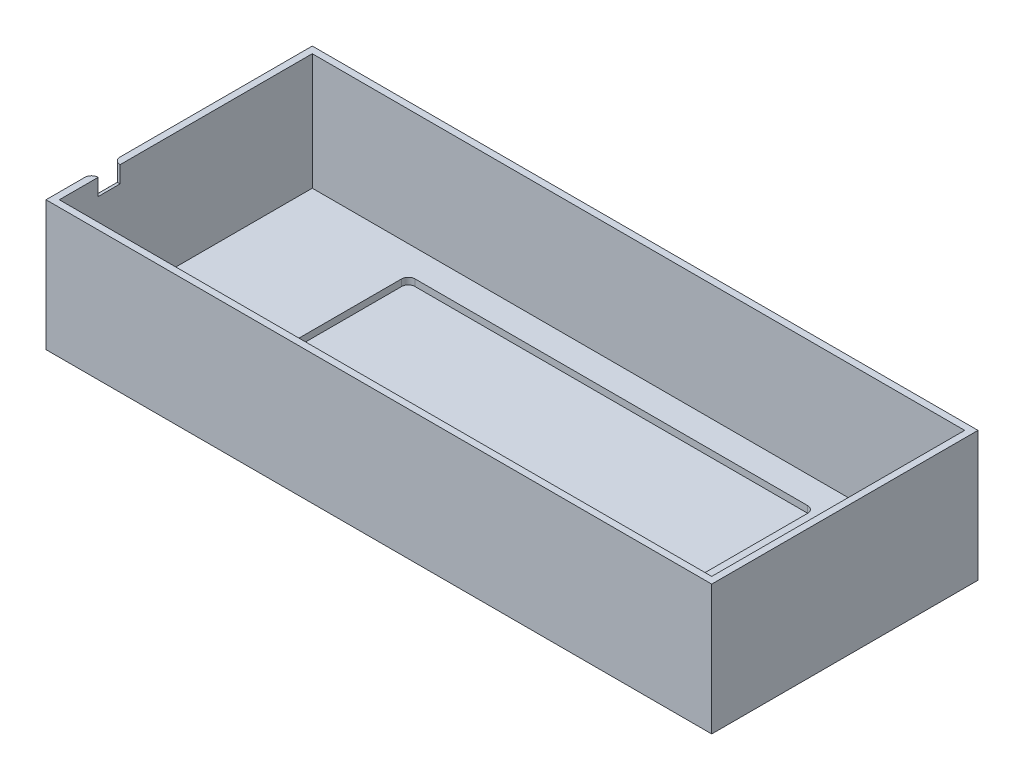
ISO-10303-21;
HEADER;
FILE_DESCRIPTION(('STEP AP214'),'2;1');
FILE_NAME('part.step','',(''),(''),'','','');
FILE_SCHEMA(('AUTOMOTIVE_DESIGN { 1 0 10303 214 1 1 1 1 }'));
ENDSEC;
DATA;
#1=APPLICATION_CONTEXT('core data for automotive mechanical design processes');
#2=APPLICATION_PROTOCOL_DEFINITION('international standard','automotive_design',2000,#1);
#3=PRODUCT_CONTEXT('',#1,'mechanical');
#4=PRODUCT('Part','Part','',(#3));
#5=PRODUCT_RELATED_PRODUCT_CATEGORY('part','',(#4));
#6=PRODUCT_DEFINITION_FORMATION('','',#4);
#7=PRODUCT_DEFINITION_CONTEXT('part definition',#1,'design');
#8=PRODUCT_DEFINITION('design','',#6,#7);
#9=PRODUCT_DEFINITION_SHAPE('','',#8);
#10=(LENGTH_UNIT() NAMED_UNIT(*) SI_UNIT(.MILLI.,.METRE.));
#11=(NAMED_UNIT(*) PLANE_ANGLE_UNIT() SI_UNIT($,.RADIAN.));
#12=(NAMED_UNIT(*) SI_UNIT($,.STERADIAN.) SOLID_ANGLE_UNIT());
#13=UNCERTAINTY_MEASURE_WITH_UNIT(LENGTH_MEASURE(1.E-05),#10,'distance_accuracy_value','');
#14=(GEOMETRIC_REPRESENTATION_CONTEXT(3) GLOBAL_UNCERTAINTY_ASSIGNED_CONTEXT((#13)) GLOBAL_UNIT_ASSIGNED_CONTEXT((#10,
#11,#12)) REPRESENTATION_CONTEXT('',''));
#15=CARTESIAN_POINT('',(0.,0.,0.));
#16=DIRECTION('',(0.,0.,1.));
#17=DIRECTION('',(1.,0.,0.));
#18=AXIS2_PLACEMENT_3D('',#15,#16,#17);
#19=CARTESIAN_POINT('',(0.,2.,0.));
#20=DIRECTION('',(0.,-1.,0.));
#21=DIRECTION('',(0.,0.,-1.));
#22=AXIS2_PLACEMENT_3D('',#19,#20,#21);
#23=PLANE('',#22);
#24=DIRECTION('',(0.,0.,1.));
#25=VECTOR('',#24,1.);
#26=CARTESIAN_POINT('',(-98.,2.,0.));
#27=LINE('',#26,#25);
#28=CARTESIAN_POINT('',(-98.,2.,-38.));
#29=VERTEX_POINT('',#28);
#30=CARTESIAN_POINT('',(-98.,2.,38.));
#31=VERTEX_POINT('',#30);
#32=EDGE_CURVE('E307',#29,#31,#27,.T.);
#33=ORIENTED_EDGE('',*,*,#32,.T.);
#34=DIRECTION('',(1.,0.,0.));
#35=VECTOR('',#34,1.);
#36=CARTESIAN_POINT('',(0.,2.,38.));
#37=LINE('',#36,#35);
#38=CARTESIAN_POINT('',(98.,2.,38.));
#39=VERTEX_POINT('',#38);
#40=EDGE_CURVE('E320',#31,#39,#37,.T.);
#41=ORIENTED_EDGE('',*,*,#40,.T.);
#42=DIRECTION('',(0.,0.,-1.));
#43=VECTOR('',#42,1.);
#44=CARTESIAN_POINT('',(98.,2.,0.));
#45=LINE('',#44,#43);
#46=CARTESIAN_POINT('',(98.,2.,-38.));
#47=VERTEX_POINT('',#46);
#48=EDGE_CURVE('E203',#39,#47,#45,.T.);
#49=ORIENTED_EDGE('',*,*,#48,.T.);
#50=DIRECTION('',(-1.,0.,0.));
#51=VECTOR('',#50,1.);
#52=CARTESIAN_POINT('',(0.,2.,-38.));
#53=LINE('',#52,#51);
#54=EDGE_CURVE('E200',#47,#29,#53,.T.);
#55=ORIENTED_EDGE('',*,*,#54,.T.);
#56=EDGE_LOOP('',(#33,#41,#49,#55));
#57=FACE_BOUND('',#56,.T.);
#58=DIRECTION('',(0.,0.,1.));
#59=VECTOR('',#58,1.);
#60=CARTESIAN_POINT('',(-61.,2.,-29.845));
#61=LINE('',#60,#59);
#62=CARTESIAN_POINT('',(-61.,2.,-27.845));
#63=VERTEX_POINT('',#62);
#64=CARTESIAN_POINT('',(-61.,2.,27.845));
#65=VERTEX_POINT('',#64);
#66=EDGE_CURVE('E293',#63,#65,#61,.T.);
#67=ORIENTED_EDGE('',*,*,#66,.F.);
#68=CARTESIAN_POINT('',(-59.,2.,-27.845));
#69=DIRECTION('',(0.,-1.,0.));
#70=DIRECTION('',(0.,0.,-1.));
#71=AXIS2_PLACEMENT_3D('',#68,#69,#70);
#72=CIRCLE('',#71,2.);
#73=CARTESIAN_POINT('',(-59.,2.,-29.845));
#74=VERTEX_POINT('',#73);
#75=EDGE_CURVE('E266',#63,#74,#72,.T.);
#76=ORIENTED_EDGE('',*,*,#75,.T.);
#77=DIRECTION('',(-1.,0.,0.));
#78=VECTOR('',#77,1.);
#79=CARTESIAN_POINT('',(61.,2.,-29.845));
#80=LINE('',#79,#78);
#81=CARTESIAN_POINT('',(59.,2.,-29.845));
#82=VERTEX_POINT('',#81);
#83=EDGE_CURVE('E298',#82,#74,#80,.T.);
#84=ORIENTED_EDGE('',*,*,#83,.F.);
#85=CARTESIAN_POINT('',(59.,2.,-27.845));
#86=DIRECTION('',(0.,-1.,0.));
#87=DIRECTION('',(0.,0.,-1.));
#88=AXIS2_PLACEMENT_3D('',#85,#86,#87);
#89=CIRCLE('',#88,2.);
#90=CARTESIAN_POINT('',(61.,2.,-27.845));
#91=VERTEX_POINT('',#90);
#92=EDGE_CURVE('E262',#82,#91,#89,.T.);
#93=ORIENTED_EDGE('',*,*,#92,.T.);
#94=DIRECTION('',(0.,0.,-1.));
#95=VECTOR('',#94,1.);
#96=CARTESIAN_POINT('',(61.,2.,-29.845));
#97=LINE('',#96,#95);
#98=CARTESIAN_POINT('',(61.,2.,27.845));
#99=VERTEX_POINT('',#98);
#100=EDGE_CURVE('E313',#99,#91,#97,.T.);
#101=ORIENTED_EDGE('',*,*,#100,.F.);
#102=CARTESIAN_POINT('',(59.,2.,27.845));
#103=DIRECTION('',(0.,-1.,0.));
#104=DIRECTION('',(0.,0.,-1.));
#105=AXIS2_PLACEMENT_3D('',#102,#103,#104);
#106=CIRCLE('',#105,2.);
#107=CARTESIAN_POINT('',(59.,2.,29.845));
#108=VERTEX_POINT('',#107);
#109=EDGE_CURVE('E260',#99,#108,#106,.T.);
#110=ORIENTED_EDGE('',*,*,#109,.T.);
#111=DIRECTION('',(1.,0.,0.));
#112=VECTOR('',#111,1.);
#113=CARTESIAN_POINT('',(61.,2.,29.845));
#114=LINE('',#113,#112);
#115=CARTESIAN_POINT('',(-59.,2.,29.845));
#116=VERTEX_POINT('',#115);
#117=EDGE_CURVE('E310',#116,#108,#114,.T.);
#118=ORIENTED_EDGE('',*,*,#117,.F.);
#119=CARTESIAN_POINT('',(-59.,2.,27.845));
#120=DIRECTION('',(0.,-1.,0.));
#121=DIRECTION('',(0.,0.,-1.));
#122=AXIS2_PLACEMENT_3D('',#119,#120,#121);
#123=CIRCLE('',#122,2.);
#124=EDGE_CURVE('E264',#116,#65,#123,.T.);
#125=ORIENTED_EDGE('',*,*,#124,.T.);
#126=EDGE_LOOP('',(#67,#76,#84,#93,#101,#110,#118,#125));
#127=FACE_BOUND('',#126,.T.);
#128=ADVANCED_FACE('F42',(#57,#127),#23,.F.);
#129=CARTESIAN_POINT('',(0.,37.,0.));
#130=DIRECTION('',(0.,-1.,0.));
#131=DIRECTION('',(0.,0.,-1.));
#132=AXIS2_PLACEMENT_3D('',#129,#130,#131);
#133=PLANE('',#132);
#134=DIRECTION('',(0.,0.,1.));
#135=VECTOR('',#134,1.);
#136=CARTESIAN_POINT('',(-98.,37.,0.));
#137=LINE('',#136,#135);
#138=CARTESIAN_POINT('',(-98.,37.,26.33));
#139=VERTEX_POINT('',#138);
#140=CARTESIAN_POINT('',(-98.,37.,38.));
#141=VERTEX_POINT('',#140);
#142=EDGE_CURVE('E189',#139,#141,#137,.T.);
#143=ORIENTED_EDGE('',*,*,#142,.F.);
#144=CARTESIAN_POINT('',(-98.,37.,28.33));
#145=DIRECTION('',(0.,-1.,0.));
#146=DIRECTION('',(0.,0.,-1.));
#147=AXIS2_PLACEMENT_3D('',#144,#145,#146);
#148=CIRCLE('',#147,2.);
#149=CARTESIAN_POINT('',(-100.,37.,28.33));
#150=VERTEX_POINT('',#149);
#151=EDGE_CURVE('E177',#139,#150,#148,.F.);
#152=ORIENTED_EDGE('',*,*,#151,.T.);
#153=DIRECTION('',(0.,0.,1.));
#154=VECTOR('',#153,1.);
#155=CARTESIAN_POINT('',(-100.,37.,-40.));
#156=LINE('',#155,#154);
#157=CARTESIAN_POINT('',(-100.,37.,40.));
#158=VERTEX_POINT('',#157);
#159=EDGE_CURVE('E218',#150,#158,#156,.T.);
#160=ORIENTED_EDGE('',*,*,#159,.T.);
#161=DIRECTION('',(1.,0.,0.));
#162=VECTOR('',#161,1.);
#163=CARTESIAN_POINT('',(100.,37.,40.));
#164=LINE('',#163,#162);
#165=CARTESIAN_POINT('',(100.,37.,40.));
#166=VERTEX_POINT('',#165);
#167=EDGE_CURVE('E217',#158,#166,#164,.T.);
#168=ORIENTED_EDGE('',*,*,#167,.T.);
#169=DIRECTION('',(0.,0.,-1.));
#170=VECTOR('',#169,1.);
#171=CARTESIAN_POINT('',(100.,37.,-40.));
#172=LINE('',#171,#170);
#173=CARTESIAN_POINT('',(100.,37.,-40.));
#174=VERTEX_POINT('',#173);
#175=EDGE_CURVE('E220',#166,#174,#172,.T.);
#176=ORIENTED_EDGE('',*,*,#175,.T.);
#177=DIRECTION('',(-1.,0.,0.));
#178=VECTOR('',#177,1.);
#179=CARTESIAN_POINT('',(100.,37.,-40.));
#180=LINE('',#179,#178);
#181=CARTESIAN_POINT('',(-100.,37.,-40.));
#182=VERTEX_POINT('',#181);
#183=EDGE_CURVE('E222',#174,#182,#180,.T.);
#184=ORIENTED_EDGE('',*,*,#183,.T.);
#185=CARTESIAN_POINT('',(-100.,37.,17.7544689442229));
#186=VERTEX_POINT('',#185);
#187=EDGE_CURVE('E214',#182,#186,#156,.T.);
#188=ORIENTED_EDGE('',*,*,#187,.T.);
#189=CARTESIAN_POINT('',(-98.,37.,17.7544689442229));
#190=DIRECTION('',(0.,-1.,0.));
#191=DIRECTION('',(0.,0.,-1.));
#192=AXIS2_PLACEMENT_3D('',#189,#190,#191);
#193=CIRCLE('',#192,2.);
#194=CARTESIAN_POINT('',(-98.,37.,19.7544689442229));
#195=VERTEX_POINT('',#194);
#196=EDGE_CURVE('E184',#186,#195,#193,.F.);
#197=ORIENTED_EDGE('',*,*,#196,.T.);
#198=CARTESIAN_POINT('',(-98.,37.,-38.));
#199=VERTEX_POINT('',#198);
#200=EDGE_CURVE('E199',#199,#195,#137,.T.);
#201=ORIENTED_EDGE('',*,*,#200,.F.);
#202=DIRECTION('',(-1.,0.,0.));
#203=VECTOR('',#202,1.);
#204=CARTESIAN_POINT('',(0.,37.,-38.));
#205=LINE('',#204,#203);
#206=CARTESIAN_POINT('',(98.,37.,-38.));
#207=VERTEX_POINT('',#206);
#208=EDGE_CURVE('E211',#207,#199,#205,.T.);
#209=ORIENTED_EDGE('',*,*,#208,.F.);
#210=DIRECTION('',(0.,0.,-1.));
#211=VECTOR('',#210,1.);
#212=CARTESIAN_POINT('',(98.,37.,0.));
#213=LINE('',#212,#211);
#214=CARTESIAN_POINT('',(98.,37.,38.));
#215=VERTEX_POINT('',#214);
#216=EDGE_CURVE('E208',#215,#207,#213,.T.);
#217=ORIENTED_EDGE('',*,*,#216,.F.);
#218=DIRECTION('',(1.,0.,0.));
#219=VECTOR('',#218,1.);
#220=CARTESIAN_POINT('',(0.,37.,38.));
#221=LINE('',#220,#219);
#222=EDGE_CURVE('E198',#141,#215,#221,.T.);
#223=ORIENTED_EDGE('',*,*,#222,.F.);
#224=EDGE_LOOP('',(#143,#152,#160,#168,#176,#184,#188,#197,#201,#209,#217,#223));
#225=FACE_BOUND('',#224,.T.);
#226=ADVANCED_FACE('F196',(#225),#133,.F.);
#227=CARTESIAN_POINT('',(-100.,37.,-40.));
#228=DIRECTION('',(1.,0.,0.));
#229=DIRECTION('',(0.,0.,-1.));
#230=AXIS2_PLACEMENT_3D('',#227,#228,#229);
#231=PLANE('',#230);
#232=ORIENTED_EDGE('',*,*,#159,.F.);
#233=DIRECTION('',(0.,1.,0.));
#234=VECTOR('',#233,1.);
#235=CARTESIAN_POINT('',(-100.,37.,28.33));
#236=LINE('',#235,#234);
#237=CARTESIAN_POINT('',(-100.,30.,28.33));
#238=VERTEX_POINT('',#237);
#239=EDGE_CURVE('E11',#150,#238,#236,.F.);
#240=ORIENTED_EDGE('',*,*,#239,.T.);
#241=DIRECTION('',(0.,0.,1.));
#242=VECTOR('',#241,1.);
#243=CARTESIAN_POINT('',(-100.,30.0000000000001,-40.));
#244=LINE('',#243,#242);
#245=CARTESIAN_POINT('',(-100.,30.,17.7544689442229));
#246=VERTEX_POINT('',#245);
#247=EDGE_CURVE('E58',#238,#246,#244,.F.);
#248=ORIENTED_EDGE('',*,*,#247,.T.);
#249=DIRECTION('',(0.,-1.,0.));
#250=VECTOR('',#249,1.);
#251=CARTESIAN_POINT('',(-100.,37.,17.7544689442229));
#252=LINE('',#251,#250);
#253=EDGE_CURVE('E51',#246,#186,#252,.F.);
#254=ORIENTED_EDGE('',*,*,#253,.T.);
#255=ORIENTED_EDGE('',*,*,#187,.F.);
#256=DIRECTION('',(0.,-1.,0.));
#257=VECTOR('',#256,1.);
#258=CARTESIAN_POINT('',(-100.,37.,-40.));
#259=LINE('',#258,#257);
#260=CARTESIAN_POINT('',(-100.,-2.,-40.));
#261=VERTEX_POINT('',#260);
#262=EDGE_CURVE('E224',#182,#261,#259,.T.);
#263=ORIENTED_EDGE('',*,*,#262,.T.);
#264=DIRECTION('',(0.,0.,-1.));
#265=VECTOR('',#264,1.);
#266=CARTESIAN_POINT('',(-100.,-2.,40.));
#267=LINE('',#266,#265);
#268=CARTESIAN_POINT('',(-100.,-2.,40.));
#269=VERTEX_POINT('',#268);
#270=EDGE_CURVE('E276',#269,#261,#267,.T.);
#271=ORIENTED_EDGE('',*,*,#270,.F.);
#272=DIRECTION('',(0.,-1.,0.));
#273=VECTOR('',#272,1.);
#274=CARTESIAN_POINT('',(-100.,37.,40.));
#275=LINE('',#274,#273);
#276=EDGE_CURVE('E230',#158,#269,#275,.T.);
#277=ORIENTED_EDGE('',*,*,#276,.F.);
#278=EDGE_LOOP('',(#232,#240,#248,#254,#255,#263,#271,#277));
#279=FACE_BOUND('',#278,.T.);
#280=ADVANCED_FACE('F363',(#279),#231,.F.);
#281=CARTESIAN_POINT('',(100.,37.,40.));
#282=DIRECTION('',(0.,0.,-1.));
#283=DIRECTION('',(-1.,0.,0.));
#284=AXIS2_PLACEMENT_3D('',#281,#282,#283);
#285=PLANE('',#284);
#286=ORIENTED_EDGE('',*,*,#276,.T.);
#287=DIRECTION('',(-1.,0.,0.));
#288=VECTOR('',#287,1.);
#289=CARTESIAN_POINT('',(-100.,-2.,40.));
#290=LINE('',#289,#288);
#291=CARTESIAN_POINT('',(100.,-2.,40.));
#292=VERTEX_POINT('',#291);
#293=EDGE_CURVE('E291',#292,#269,#290,.T.);
#294=ORIENTED_EDGE('',*,*,#293,.F.);
#295=DIRECTION('',(0.,-1.,0.));
#296=VECTOR('',#295,1.);
#297=CARTESIAN_POINT('',(100.,37.,40.));
#298=LINE('',#297,#296);
#299=EDGE_CURVE('E228',#166,#292,#298,.T.);
#300=ORIENTED_EDGE('',*,*,#299,.F.);
#301=ORIENTED_EDGE('',*,*,#167,.F.);
#302=EDGE_LOOP('',(#286,#294,#300,#301));
#303=FACE_BOUND('',#302,.T.);
#304=ADVANCED_FACE('F375',(#303),#285,.F.);
#305=CARTESIAN_POINT('',(100.,37.,-40.));
#306=DIRECTION('',(-1.,0.,0.));
#307=DIRECTION('',(0.,0.,1.));
#308=AXIS2_PLACEMENT_3D('',#305,#306,#307);
#309=PLANE('',#308);
#310=ORIENTED_EDGE('',*,*,#299,.T.);
#311=DIRECTION('',(0.,0.,1.));
#312=VECTOR('',#311,1.);
#313=CARTESIAN_POINT('',(100.,-2.,40.));
#314=LINE('',#313,#312);
#315=CARTESIAN_POINT('',(100.,-2.,-40.));
#316=VERTEX_POINT('',#315);
#317=EDGE_CURVE('E286',#316,#292,#314,.T.);
#318=ORIENTED_EDGE('',*,*,#317,.F.);
#319=DIRECTION('',(0.,-1.,0.));
#320=VECTOR('',#319,1.);
#321=CARTESIAN_POINT('',(100.,37.,-40.));
#322=LINE('',#321,#320);
#323=EDGE_CURVE('E226',#174,#316,#322,.T.);
#324=ORIENTED_EDGE('',*,*,#323,.F.);
#325=ORIENTED_EDGE('',*,*,#175,.F.);
#326=EDGE_LOOP('',(#310,#318,#324,#325));
#327=FACE_BOUND('',#326,.T.);
#328=ADVANCED_FACE('F371',(#327),#309,.F.);
#329=CARTESIAN_POINT('',(100.,37.,-40.));
#330=DIRECTION('',(0.,0.,1.));
#331=DIRECTION('',(1.,0.,0.));
#332=AXIS2_PLACEMENT_3D('',#329,#330,#331);
#333=PLANE('',#332);
#334=ORIENTED_EDGE('',*,*,#323,.T.);
#335=DIRECTION('',(1.,0.,0.));
#336=VECTOR('',#335,1.);
#337=CARTESIAN_POINT('',(-100.,-2.,-40.));
#338=LINE('',#337,#336);
#339=EDGE_CURVE('E280',#261,#316,#338,.T.);
#340=ORIENTED_EDGE('',*,*,#339,.F.);
#341=ORIENTED_EDGE('',*,*,#262,.F.);
#342=ORIENTED_EDGE('',*,*,#183,.F.);
#343=EDGE_LOOP('',(#334,#340,#341,#342));
#344=FACE_BOUND('',#343,.T.);
#345=ADVANCED_FACE('F368',(#344),#333,.F.);
#346=CARTESIAN_POINT('',(-98.,37.,-40.));
#347=DIRECTION('',(1.,0.,0.));
#348=DIRECTION('',(0.,0.,-1.));
#349=AXIS2_PLACEMENT_3D('',#346,#347,#348);
#350=PLANE('',#349);
#351=DIRECTION('',(0.,-1.,0.));
#352=VECTOR('',#351,1.);
#353=CARTESIAN_POINT('',(-98.,37.,26.33));
#354=LINE('',#353,#352);
#355=CARTESIAN_POINT('',(-98.,32.,26.33));
#356=VERTEX_POINT('',#355);
#357=EDGE_CURVE('E181',#139,#356,#354,.T.);
#358=ORIENTED_EDGE('',*,*,#357,.F.);
#359=ORIENTED_EDGE('',*,*,#142,.T.);
#360=DIRECTION('',(0.,-1.,0.));
#361=VECTOR('',#360,1.);
#362=CARTESIAN_POINT('',(-98.,37.,38.));
#363=LINE('',#362,#361);
#364=EDGE_CURVE('E321',#141,#31,#363,.T.);
#365=ORIENTED_EDGE('',*,*,#364,.T.);
#366=ORIENTED_EDGE('',*,*,#32,.F.);
#367=DIRECTION('',(0.,-1.,0.));
#368=VECTOR('',#367,1.);
#369=CARTESIAN_POINT('',(-98.,37.,-38.));
#370=LINE('',#369,#368);
#371=EDGE_CURVE('E213',#199,#29,#370,.T.);
#372=ORIENTED_EDGE('',*,*,#371,.F.);
#373=ORIENTED_EDGE('',*,*,#200,.T.);
#374=DIRECTION('',(0.,1.,0.));
#375=VECTOR('',#374,1.);
#376=CARTESIAN_POINT('',(-98.,37.,19.7544689442229));
#377=LINE('',#376,#375);
#378=CARTESIAN_POINT('',(-98.,32.,19.7544689442229));
#379=VERTEX_POINT('',#378);
#380=EDGE_CURVE('E268',#379,#195,#377,.T.);
#381=ORIENTED_EDGE('',*,*,#380,.F.);
#382=DIRECTION('',(0.,0.,-1.));
#383=VECTOR('',#382,1.);
#384=CARTESIAN_POINT('',(-98.,32.0000000000001,-40.));
#385=LINE('',#384,#383);
#386=EDGE_CURVE('E192',#356,#379,#385,.T.);
#387=ORIENTED_EDGE('',*,*,#386,.F.);
#388=EDGE_LOOP('',(#358,#359,#365,#366,#372,#373,#381,#387));
#389=FACE_BOUND('',#388,.T.);
#390=ADVANCED_FACE('F187',(#389),#350,.T.);
#391=CARTESIAN_POINT('',(100.,37.,38.));
#392=DIRECTION('',(0.,0.,-1.));
#393=DIRECTION('',(-1.,0.,0.));
#394=AXIS2_PLACEMENT_3D('',#391,#392,#393);
#395=PLANE('',#394);
#396=ORIENTED_EDGE('',*,*,#40,.F.);
#397=ORIENTED_EDGE('',*,*,#364,.F.);
#398=ORIENTED_EDGE('',*,*,#222,.T.);
#399=DIRECTION('',(0.,-1.,0.));
#400=VECTOR('',#399,1.);
#401=CARTESIAN_POINT('',(98.,37.,38.));
#402=LINE('',#401,#400);
#403=EDGE_CURVE('E323',#215,#39,#402,.T.);
#404=ORIENTED_EDGE('',*,*,#403,.T.);
#405=EDGE_LOOP('',(#396,#397,#398,#404));
#406=FACE_BOUND('',#405,.T.);
#407=ADVANCED_FACE('F344',(#406),#395,.T.);
#408=CARTESIAN_POINT('',(98.,37.,-40.));
#409=DIRECTION('',(-1.,0.,0.));
#410=DIRECTION('',(0.,0.,1.));
#411=AXIS2_PLACEMENT_3D('',#408,#409,#410);
#412=PLANE('',#411);
#413=ORIENTED_EDGE('',*,*,#48,.F.);
#414=ORIENTED_EDGE('',*,*,#403,.F.);
#415=ORIENTED_EDGE('',*,*,#216,.T.);
#416=DIRECTION('',(0.,-1.,0.));
#417=VECTOR('',#416,1.);
#418=CARTESIAN_POINT('',(98.,37.,-38.));
#419=LINE('',#418,#417);
#420=EDGE_CURVE('E326',#207,#47,#419,.T.);
#421=ORIENTED_EDGE('',*,*,#420,.T.);
#422=EDGE_LOOP('',(#413,#414,#415,#421));
#423=FACE_BOUND('',#422,.T.);
#424=ADVANCED_FACE('F334',(#423),#412,.T.);
#425=CARTESIAN_POINT('',(100.,37.,-38.));
#426=DIRECTION('',(0.,0.,1.));
#427=DIRECTION('',(1.,0.,0.));
#428=AXIS2_PLACEMENT_3D('',#425,#426,#427);
#429=PLANE('',#428);
#430=ORIENTED_EDGE('',*,*,#54,.F.);
#431=ORIENTED_EDGE('',*,*,#420,.F.);
#432=ORIENTED_EDGE('',*,*,#208,.T.);
#433=ORIENTED_EDGE('',*,*,#371,.T.);
#434=EDGE_LOOP('',(#430,#431,#432,#433));
#435=FACE_BOUND('',#434,.T.);
#436=ADVANCED_FACE('F338',(#435),#429,.T.);
#437=CARTESIAN_POINT('',(-61.,0.,-29.845));
#438=DIRECTION('',(-1.,0.,0.));
#439=DIRECTION('',(0.,0.,1.));
#440=AXIS2_PLACEMENT_3D('',#437,#438,#439);
#441=PLANE('',#440);
#442=ORIENTED_EDGE('',*,*,#66,.T.);
#443=DIRECTION('',(0.,1.,0.));
#444=VECTOR('',#443,1.);
#445=CARTESIAN_POINT('',(-61.,0.,27.845));
#446=LINE('',#445,#444);
#447=CARTESIAN_POINT('',(-61.,0.,27.845));
#448=VERTEX_POINT('',#447);
#449=EDGE_CURVE('E258',#65,#448,#446,.F.);
#450=ORIENTED_EDGE('',*,*,#449,.T.);
#451=DIRECTION('',(0.,0.,1.));
#452=VECTOR('',#451,1.);
#453=CARTESIAN_POINT('',(-61.,0.,-29.845));
#454=LINE('',#453,#452);
#455=CARTESIAN_POINT('',(-61.,0.,-27.845));
#456=VERTEX_POINT('',#455);
#457=EDGE_CURVE('E294',#456,#448,#454,.T.);
#458=ORIENTED_EDGE('',*,*,#457,.F.);
#459=DIRECTION('',(0.,1.,0.));
#460=VECTOR('',#459,1.);
#461=CARTESIAN_POINT('',(-61.,2.,-27.845));
#462=LINE('',#461,#460);
#463=EDGE_CURVE('E255',#456,#63,#462,.T.);
#464=ORIENTED_EDGE('',*,*,#463,.T.);
#465=EDGE_LOOP('',(#442,#450,#458,#464));
#466=FACE_BOUND('',#465,.T.);
#467=ADVANCED_FACE('F408',(#466),#441,.F.);
#468=CARTESIAN_POINT('',(61.,0.,-29.845));
#469=DIRECTION('',(0.,0.,-1.));
#470=DIRECTION('',(-1.,0.,0.));
#471=AXIS2_PLACEMENT_3D('',#468,#469,#470);
#472=PLANE('',#471);
#473=DIRECTION('',(-1.,0.,0.));
#474=VECTOR('',#473,1.);
#475=CARTESIAN_POINT('',(61.,0.,-29.845));
#476=LINE('',#475,#474);
#477=CARTESIAN_POINT('',(59.,0.,-29.845));
#478=VERTEX_POINT('',#477);
#479=CARTESIAN_POINT('',(-59.,0.,-29.845));
#480=VERTEX_POINT('',#479);
#481=EDGE_CURVE('E304',#478,#480,#476,.T.);
#482=ORIENTED_EDGE('',*,*,#481,.F.);
#483=DIRECTION('',(0.,1.,0.));
#484=VECTOR('',#483,1.);
#485=CARTESIAN_POINT('',(59.,2.,-29.845));
#486=LINE('',#485,#484);
#487=EDGE_CURVE('E252',#478,#82,#486,.T.);
#488=ORIENTED_EDGE('',*,*,#487,.T.);
#489=ORIENTED_EDGE('',*,*,#83,.T.);
#490=DIRECTION('',(0.,1.,0.));
#491=VECTOR('',#490,1.);
#492=CARTESIAN_POINT('',(-59.,0.,-29.845));
#493=LINE('',#492,#491);
#494=EDGE_CURVE('E250',#74,#480,#493,.F.);
#495=ORIENTED_EDGE('',*,*,#494,.T.);
#496=EDGE_LOOP('',(#482,#488,#489,#495));
#497=FACE_BOUND('',#496,.T.);
#498=ADVANCED_FACE('F427',(#497),#472,.F.);
#499=CARTESIAN_POINT('',(61.,0.,-29.845));
#500=DIRECTION('',(1.,0.,0.));
#501=DIRECTION('',(0.,0.,-1.));
#502=AXIS2_PLACEMENT_3D('',#499,#500,#501);
#503=PLANE('',#502);
#504=DIRECTION('',(0.,0.,-1.));
#505=VECTOR('',#504,1.);
#506=CARTESIAN_POINT('',(61.,0.,-29.845));
#507=LINE('',#506,#505);
#508=CARTESIAN_POINT('',(61.,0.,27.845));
#509=VERTEX_POINT('',#508);
#510=CARTESIAN_POINT('',(61.,0.,-27.845));
#511=VERTEX_POINT('',#510);
#512=EDGE_CURVE('E301',#509,#511,#507,.T.);
#513=ORIENTED_EDGE('',*,*,#512,.F.);
#514=DIRECTION('',(0.,1.,0.));
#515=VECTOR('',#514,1.);
#516=CARTESIAN_POINT('',(61.,2.,27.845));
#517=LINE('',#516,#515);
#518=EDGE_CURVE('E234',#509,#99,#517,.T.);
#519=ORIENTED_EDGE('',*,*,#518,.T.);
#520=ORIENTED_EDGE('',*,*,#100,.T.);
#521=DIRECTION('',(0.,1.,0.));
#522=VECTOR('',#521,1.);
#523=CARTESIAN_POINT('',(61.,0.,-27.845));
#524=LINE('',#523,#522);
#525=EDGE_CURVE('E232',#91,#511,#524,.F.);
#526=ORIENTED_EDGE('',*,*,#525,.T.);
#527=EDGE_LOOP('',(#513,#519,#520,#526));
#528=FACE_BOUND('',#527,.T.);
#529=ADVANCED_FACE('F422',(#528),#503,.F.);
#530=CARTESIAN_POINT('',(61.,0.,29.845));
#531=DIRECTION('',(0.,0.,1.));
#532=DIRECTION('',(1.,0.,0.));
#533=AXIS2_PLACEMENT_3D('',#530,#531,#532);
#534=PLANE('',#533);
#535=ORIENTED_EDGE('',*,*,#117,.T.);
#536=DIRECTION('',(0.,1.,0.));
#537=VECTOR('',#536,1.);
#538=CARTESIAN_POINT('',(59.,0.,29.845));
#539=LINE('',#538,#537);
#540=CARTESIAN_POINT('',(59.,0.,29.845));
#541=VERTEX_POINT('',#540);
#542=EDGE_CURVE('E240',#108,#541,#539,.F.);
#543=ORIENTED_EDGE('',*,*,#542,.T.);
#544=DIRECTION('',(1.,0.,0.));
#545=VECTOR('',#544,1.);
#546=CARTESIAN_POINT('',(61.,0.,29.845));
#547=LINE('',#546,#545);
#548=CARTESIAN_POINT('',(-59.,0.,29.845));
#549=VERTEX_POINT('',#548);
#550=EDGE_CURVE('E297',#549,#541,#547,.T.);
#551=ORIENTED_EDGE('',*,*,#550,.F.);
#552=DIRECTION('',(0.,1.,0.));
#553=VECTOR('',#552,1.);
#554=CARTESIAN_POINT('',(-59.,2.,29.845));
#555=LINE('',#554,#553);
#556=EDGE_CURVE('E237',#549,#116,#555,.T.);
#557=ORIENTED_EDGE('',*,*,#556,.T.);
#558=EDGE_LOOP('',(#535,#543,#551,#557));
#559=FACE_BOUND('',#558,.T.);
#560=ADVANCED_FACE('F415',(#559),#534,.F.);
#561=CARTESIAN_POINT('',(0.,0.,0.));
#562=DIRECTION('',(0.,-1.,0.));
#563=DIRECTION('',(0.,0.,-1.));
#564=AXIS2_PLACEMENT_3D('',#561,#562,#563);
#565=PLANE('',#564);
#566=ORIENTED_EDGE('',*,*,#550,.T.);
#567=CARTESIAN_POINT('',(59.,0.,27.845));
#568=DIRECTION('',(0.,-1.,0.));
#569=DIRECTION('',(0.,0.,-1.));
#570=AXIS2_PLACEMENT_3D('',#567,#568,#569);
#571=CIRCLE('',#570,2.);
#572=EDGE_CURVE('E248',#541,#509,#571,.F.);
#573=ORIENTED_EDGE('',*,*,#572,.T.);
#574=ORIENTED_EDGE('',*,*,#512,.T.);
#575=CARTESIAN_POINT('',(59.,0.,-27.845));
#576=DIRECTION('',(0.,-1.,0.));
#577=DIRECTION('',(0.,0.,-1.));
#578=AXIS2_PLACEMENT_3D('',#575,#576,#577);
#579=CIRCLE('',#578,2.);
#580=EDGE_CURVE('E246',#511,#478,#579,.F.);
#581=ORIENTED_EDGE('',*,*,#580,.T.);
#582=ORIENTED_EDGE('',*,*,#481,.T.);
#583=CARTESIAN_POINT('',(-59.,0.,-27.845));
#584=DIRECTION('',(0.,-1.,0.));
#585=DIRECTION('',(0.,0.,-1.));
#586=AXIS2_PLACEMENT_3D('',#583,#584,#585);
#587=CIRCLE('',#586,2.);
#588=EDGE_CURVE('E242',#480,#456,#587,.F.);
#589=ORIENTED_EDGE('',*,*,#588,.T.);
#590=ORIENTED_EDGE('',*,*,#457,.T.);
#591=CARTESIAN_POINT('',(-59.,0.,27.845));
#592=DIRECTION('',(0.,-1.,0.));
#593=DIRECTION('',(0.,0.,-1.));
#594=AXIS2_PLACEMENT_3D('',#591,#592,#593);
#595=CIRCLE('',#594,2.);
#596=EDGE_CURVE('E244',#448,#549,#595,.F.);
#597=ORIENTED_EDGE('',*,*,#596,.T.);
#598=EDGE_LOOP('',(#566,#573,#574,#581,#582,#589,#590,#597));
#599=FACE_BOUND('',#598,.T.);
#600=ADVANCED_FACE('F404',(#599),#565,.F.);
#601=CARTESIAN_POINT('',(0.,-2.,0.));
#602=DIRECTION('',(0.,-1.,0.));
#603=DIRECTION('',(0.,0.,-1.));
#604=AXIS2_PLACEMENT_3D('',#601,#602,#603);
#605=PLANE('',#604);
#606=ORIENTED_EDGE('',*,*,#270,.T.);
#607=ORIENTED_EDGE('',*,*,#339,.T.);
#608=ORIENTED_EDGE('',*,*,#317,.T.);
#609=ORIENTED_EDGE('',*,*,#293,.T.);
#610=EDGE_LOOP('',(#606,#607,#608,#609));
#611=FACE_BOUND('',#610,.T.);
#612=ADVANCED_FACE('F386',(#611),#605,.T.);
#613=CARTESIAN_POINT('',(59.,0.,27.845));
#614=DIRECTION('',(0.,-1.,0.));
#615=DIRECTION('',(0.,0.,-1.));
#616=AXIS2_PLACEMENT_3D('',#613,#614,#615);
#617=CYLINDRICAL_SURFACE('',#616,2.);
#618=ORIENTED_EDGE('',*,*,#572,.F.);
#619=ORIENTED_EDGE('',*,*,#542,.F.);
#620=ORIENTED_EDGE('',*,*,#109,.F.);
#621=ORIENTED_EDGE('',*,*,#518,.F.);
#622=EDGE_LOOP('',(#618,#619,#620,#621));
#623=FACE_BOUND('',#622,.T.);
#624=ADVANCED_FACE('F382',(#623),#617,.F.);
#625=CARTESIAN_POINT('',(59.,0.,-27.845));
#626=DIRECTION('',(0.,-1.,0.));
#627=DIRECTION('',(0.,0.,-1.));
#628=AXIS2_PLACEMENT_3D('',#625,#626,#627);
#629=CYLINDRICAL_SURFACE('',#628,2.);
#630=ORIENTED_EDGE('',*,*,#580,.F.);
#631=ORIENTED_EDGE('',*,*,#525,.F.);
#632=ORIENTED_EDGE('',*,*,#92,.F.);
#633=ORIENTED_EDGE('',*,*,#487,.F.);
#634=EDGE_LOOP('',(#630,#631,#632,#633));
#635=FACE_BOUND('',#634,.T.);
#636=ADVANCED_FACE('F385',(#635),#629,.F.);
#637=CARTESIAN_POINT('',(-59.,0.,27.845));
#638=DIRECTION('',(0.,-1.,0.));
#639=DIRECTION('',(0.,0.,-1.));
#640=AXIS2_PLACEMENT_3D('',#637,#638,#639);
#641=CYLINDRICAL_SURFACE('',#640,2.);
#642=ORIENTED_EDGE('',*,*,#596,.F.);
#643=ORIENTED_EDGE('',*,*,#449,.F.);
#644=ORIENTED_EDGE('',*,*,#124,.F.);
#645=ORIENTED_EDGE('',*,*,#556,.F.);
#646=EDGE_LOOP('',(#642,#643,#644,#645));
#647=FACE_BOUND('',#646,.T.);
#648=ADVANCED_FACE('F390',(#647),#641,.F.);
#649=CARTESIAN_POINT('',(-59.,0.,-27.845));
#650=DIRECTION('',(0.,-1.,0.));
#651=DIRECTION('',(0.,0.,-1.));
#652=AXIS2_PLACEMENT_3D('',#649,#650,#651);
#653=CYLINDRICAL_SURFACE('',#652,2.);
#654=ORIENTED_EDGE('',*,*,#588,.F.);
#655=ORIENTED_EDGE('',*,*,#494,.F.);
#656=ORIENTED_EDGE('',*,*,#75,.F.);
#657=ORIENTED_EDGE('',*,*,#463,.F.);
#658=EDGE_LOOP('',(#654,#655,#656,#657));
#659=FACE_BOUND('',#658,.T.);
#660=ADVANCED_FACE('F355',(#659),#653,.F.);
#661=CARTESIAN_POINT('',(-98.,37.,17.7544689442229));
#662=DIRECTION('',(0.,-1.,0.));
#663=DIRECTION('',(0.,0.,-1.));
#664=AXIS2_PLACEMENT_3D('',#661,#662,#663);
#665=CYLINDRICAL_SURFACE('',#664,2.);
#666=ORIENTED_EDGE('',*,*,#196,.F.);
#667=ORIENTED_EDGE('',*,*,#253,.F.);
#668=CARTESIAN_POINT('',(-98.,30.,17.7544689442229));
#669=DIRECTION('',(0.,-0.707106781186548,0.707106781186547));
#670=DIRECTION('',(0.,-0.707106781186547,-0.707106781186548));
#671=AXIS2_PLACEMENT_3D('',#668,#669,#670);
#672=ELLIPSE('',#671,2.82842712474619,2.);
#673=EDGE_CURVE('E46',#379,#246,#672,.T.);
#674=ORIENTED_EDGE('',*,*,#673,.F.);
#675=ORIENTED_EDGE('',*,*,#380,.T.);
#676=EDGE_LOOP('',(#666,#667,#674,#675));
#677=FACE_BOUND('',#676,.T.);
#678=ADVANCED_FACE('F44',(#677),#665,.T.);
#679=CARTESIAN_POINT('',(-98.,30.,26.33));
#680=DIRECTION('',(0.,0.,1.));
#681=DIRECTION('',(0.,-1.,0.));
#682=AXIS2_PLACEMENT_3D('',#679,#680,#681);
#683=CYLINDRICAL_SURFACE('',#682,2.);
#684=ORIENTED_EDGE('',*,*,#673,.T.);
#685=ORIENTED_EDGE('',*,*,#247,.F.);
#686=CARTESIAN_POINT('',(-98.,30.,28.33));
#687=DIRECTION('',(0.,0.707106781186547,0.707106781186548));
#688=DIRECTION('',(0.,0.707106781186548,-0.707106781186547));
#689=AXIS2_PLACEMENT_3D('',#686,#687,#688);
#690=ELLIPSE('',#689,2.82842712474619,2.);
#691=EDGE_CURVE('E274',#356,#238,#690,.T.);
#692=ORIENTED_EDGE('',*,*,#691,.F.);
#693=ORIENTED_EDGE('',*,*,#386,.T.);
#694=EDGE_LOOP('',(#684,#685,#692,#693));
#695=FACE_BOUND('',#694,.T.);
#696=ADVANCED_FACE('F348',(#695),#683,.T.);
#697=CARTESIAN_POINT('',(-98.,37.,28.33));
#698=DIRECTION('',(0.,1.,0.));
#699=DIRECTION('',(0.,0.,1.));
#700=AXIS2_PLACEMENT_3D('',#697,#698,#699);
#701=CYLINDRICAL_SURFACE('',#700,2.);
#702=ORIENTED_EDGE('',*,*,#691,.T.);
#703=ORIENTED_EDGE('',*,*,#239,.F.);
#704=ORIENTED_EDGE('',*,*,#151,.F.);
#705=ORIENTED_EDGE('',*,*,#357,.T.);
#706=EDGE_LOOP('',(#702,#703,#704,#705));
#707=FACE_BOUND('',#706,.T.);
#708=ADVANCED_FACE('F180',(#707),#701,.T.);
#709=CLOSED_SHELL('',(#128,#226,#280,#304,#328,#345,#390,#407,#424,#436,#467,#498,#529,#560,
#600,#612,#624,#636,#648,#660,#678,#696,#708));
#710=MANIFOLD_SOLID_BREP('B2',#709);
#711=ADVANCED_BREP_SHAPE_REPRESENTATION('',(#18,#710),#14);
#712=SHAPE_DEFINITION_REPRESENTATION(#9,#711);
ENDSEC;
END-ISO-10303-21;
